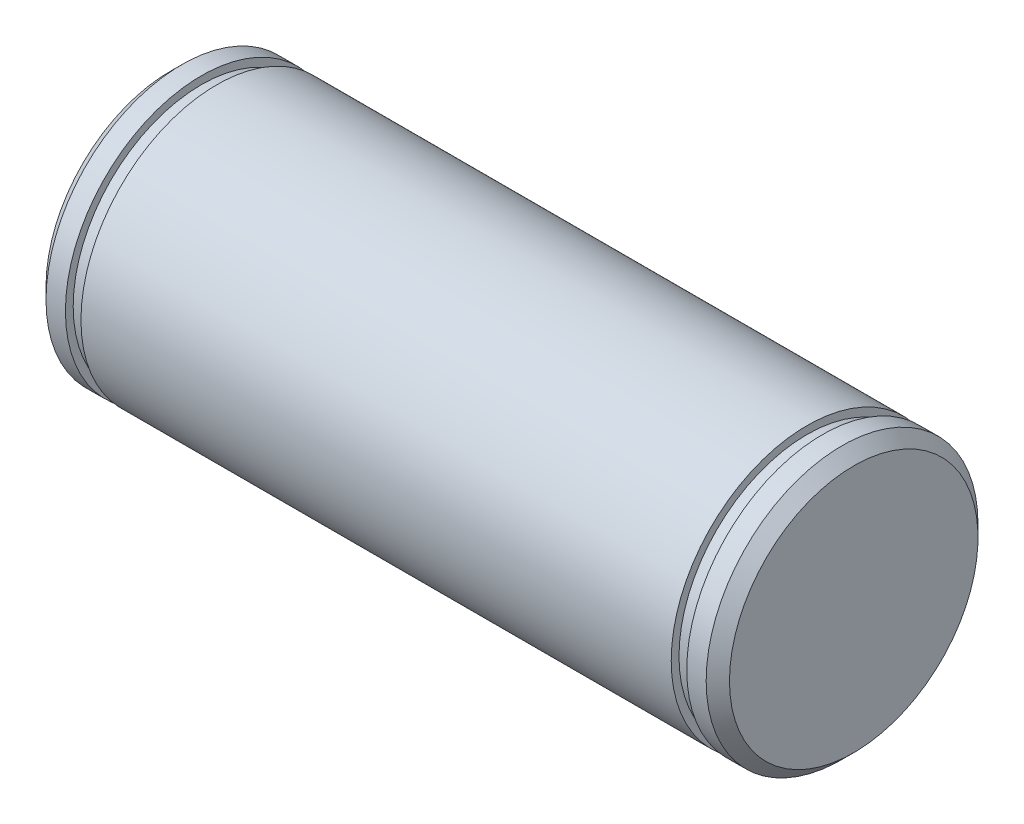
ISO-10303-21;
HEADER;
FILE_DESCRIPTION(('STEP AP214'),'2;1');
FILE_NAME('part.step','',(''),(''),'','','');
FILE_SCHEMA(('AUTOMOTIVE_DESIGN { 1 0 10303 214 1 1 1 1 }'));
ENDSEC;
DATA;
#1=APPLICATION_CONTEXT('core data for automotive mechanical design processes');
#2=APPLICATION_PROTOCOL_DEFINITION('international standard','automotive_design',2000,#1);
#3=PRODUCT_CONTEXT('',#1,'mechanical');
#4=PRODUCT('Part','Part','',(#3));
#5=PRODUCT_RELATED_PRODUCT_CATEGORY('part','',(#4));
#6=PRODUCT_DEFINITION_FORMATION('','',#4);
#7=PRODUCT_DEFINITION_CONTEXT('part definition',#1,'design');
#8=PRODUCT_DEFINITION('design','',#6,#7);
#9=PRODUCT_DEFINITION_SHAPE('','',#8);
#10=(LENGTH_UNIT() NAMED_UNIT(*) SI_UNIT(.MILLI.,.METRE.));
#11=(NAMED_UNIT(*) PLANE_ANGLE_UNIT() SI_UNIT($,.RADIAN.));
#12=(NAMED_UNIT(*) SI_UNIT($,.STERADIAN.) SOLID_ANGLE_UNIT());
#13=UNCERTAINTY_MEASURE_WITH_UNIT(LENGTH_MEASURE(1.E-05),#10,'distance_accuracy_value','');
#14=(GEOMETRIC_REPRESENTATION_CONTEXT(3) GLOBAL_UNCERTAINTY_ASSIGNED_CONTEXT((#13)) GLOBAL_UNIT_ASSIGNED_CONTEXT((#10,
#11,#12)) REPRESENTATION_CONTEXT('',''));
#15=CARTESIAN_POINT('',(0.,0.,0.));
#16=DIRECTION('',(0.,0.,1.));
#17=DIRECTION('',(1.,0.,0.));
#18=AXIS2_PLACEMENT_3D('',#15,#16,#17);
#19=CARTESIAN_POINT('',(0.,0.,0.));
#20=DIRECTION('',(-1.,0.,0.));
#21=DIRECTION('',(0.,0.,1.));
#22=AXIS2_PLACEMENT_3D('',#19,#20,#21);
#23=PLANE('',#22);
#24=CARTESIAN_POINT('',(0.,0.,0.));
#25=DIRECTION('',(-1.,0.,0.));
#26=DIRECTION('',(0.,0.,1.));
#27=AXIS2_PLACEMENT_3D('',#24,#25,#26);
#28=CIRCLE('',#27,16.);
#29=CARTESIAN_POINT('',(0.,0.,16.));
#30=VERTEX_POINT('',#29);
#31=EDGE_CURVE('E76',#30,#30,#28,.T.);
#32=ORIENTED_EDGE('',*,*,#31,.T.);
#33=EDGE_LOOP('',(#32));
#34=FACE_BOUND('',#33,.T.);
#35=ADVANCED_FACE('F36',(#34),#23,.T.);
#36=CARTESIAN_POINT('',(88.0000000000001,0.,0.));
#37=DIRECTION('',(-1.,0.,0.));
#38=DIRECTION('',(0.,0.,1.));
#39=AXIS2_PLACEMENT_3D('',#36,#37,#38);
#40=PLANE('',#39);
#41=CARTESIAN_POINT('',(88.0000000000001,0.,0.));
#42=DIRECTION('',(-1.,0.,0.));
#43=DIRECTION('',(0.,0.,1.));
#44=AXIS2_PLACEMENT_3D('',#41,#42,#43);
#45=CIRCLE('',#44,16.);
#46=CARTESIAN_POINT('',(88.0000000000001,0.,16.));
#47=VERTEX_POINT('',#46);
#48=EDGE_CURVE('E10',#47,#47,#45,.T.);
#49=ORIENTED_EDGE('',*,*,#48,.F.);
#50=EDGE_LOOP('',(#49));
#51=FACE_BOUND('',#50,.T.);
#52=ADVANCED_FACE('F117',(#51),#40,.F.);
#53=CARTESIAN_POINT('',(86.5,0.,0.));
#54=DIRECTION('',(-1.,0.,0.));
#55=DIRECTION('',(0.,0.,1.));
#56=AXIS2_PLACEMENT_3D('',#53,#54,#55);
#57=CONICAL_SURFACE('',#56,17.4999999999998,0.78539816339737);
#58=ORIENTED_EDGE('',*,*,#48,.T.);
#59=EDGE_LOOP('',(#58));
#60=FACE_BOUND('',#59,.T.);
#61=CARTESIAN_POINT('',(86.5,0.,0.));
#62=DIRECTION('',(-1.,0.,0.));
#63=DIRECTION('',(0.,0.,1.));
#64=AXIS2_PLACEMENT_3D('',#61,#62,#63);
#65=CIRCLE('',#64,17.4999999999998);
#66=CARTESIAN_POINT('',(86.5,0.,17.4999999999998));
#67=VERTEX_POINT('',#66);
#68=EDGE_CURVE('E42',#67,#67,#65,.T.);
#69=ORIENTED_EDGE('',*,*,#68,.F.);
#70=EDGE_LOOP('',(#69));
#71=FACE_BOUND('',#70,.T.);
#72=ADVANCED_FACE('F121',(#60,#71),#57,.T.);
#73=CARTESIAN_POINT('',(-1.99999999999978,0.,0.));
#74=DIRECTION('',(-1.,0.,0.));
#75=DIRECTION('',(0.,0.,1.));
#76=AXIS2_PLACEMENT_3D('',#73,#74,#75);
#77=CYLINDRICAL_SURFACE('',#76,17.4999999999998);
#78=CARTESIAN_POINT('',(84.0000000000005,0.,0.));
#79=DIRECTION('',(-1.,0.,0.));
#80=DIRECTION('',(0.,0.,1.));
#81=AXIS2_PLACEMENT_3D('',#78,#79,#80);
#82=CIRCLE('',#81,17.4999999999999);
#83=CARTESIAN_POINT('',(84.0000000000005,0.,17.4999999999999));
#84=VERTEX_POINT('',#83);
#85=EDGE_CURVE('E46',#84,#84,#82,.T.);
#86=ORIENTED_EDGE('',*,*,#85,.F.);
#87=EDGE_LOOP('',(#86));
#88=FACE_BOUND('',#87,.T.);
#89=ORIENTED_EDGE('',*,*,#68,.T.);
#90=EDGE_LOOP('',(#89));
#91=FACE_BOUND('',#90,.T.);
#92=ADVANCED_FACE('F126',(#88,#91),#77,.T.);
#93=CARTESIAN_POINT('',(84.0000000000005,0.,0.));
#94=DIRECTION('',(-1.,0.,0.));
#95=DIRECTION('',(0.,0.,1.));
#96=AXIS2_PLACEMENT_3D('',#93,#94,#95);
#97=PLANE('',#96);
#98=ORIENTED_EDGE('',*,*,#85,.T.);
#99=EDGE_LOOP('',(#98));
#100=FACE_BOUND('',#99,.T.);
#101=CARTESIAN_POINT('',(84.0000000000005,0.,0.));
#102=DIRECTION('',(-1.,0.,0.));
#103=DIRECTION('',(0.,0.,1.));
#104=AXIS2_PLACEMENT_3D('',#101,#102,#103);
#105=CIRCLE('',#104,16.5);
#106=CARTESIAN_POINT('',(84.0000000000005,0.,16.5));
#107=VERTEX_POINT('',#106);
#108=EDGE_CURVE('E50',#107,#107,#105,.T.);
#109=ORIENTED_EDGE('',*,*,#108,.F.);
#110=EDGE_LOOP('',(#109));
#111=FACE_BOUND('',#110,.T.);
#112=ADVANCED_FACE('F131',(#100,#111),#97,.T.);
#113=CARTESIAN_POINT('',(-1.99999999999978,0.,0.));
#114=DIRECTION('',(-1.,0.,0.));
#115=DIRECTION('',(0.,0.,1.));
#116=AXIS2_PLACEMENT_3D('',#113,#114,#115);
#117=CYLINDRICAL_SURFACE('',#116,16.5);
#118=ORIENTED_EDGE('',*,*,#108,.T.);
#119=EDGE_LOOP('',(#118));
#120=FACE_BOUND('',#119,.T.);
#121=CARTESIAN_POINT('',(81.9999999999999,0.,0.));
#122=DIRECTION('',(-1.,0.,0.));
#123=DIRECTION('',(0.,0.,1.));
#124=AXIS2_PLACEMENT_3D('',#121,#122,#123);
#125=CIRCLE('',#124,16.5);
#126=CARTESIAN_POINT('',(81.9999999999999,0.,16.5));
#127=VERTEX_POINT('',#126);
#128=EDGE_CURVE('E55',#127,#127,#125,.T.);
#129=ORIENTED_EDGE('',*,*,#128,.F.);
#130=EDGE_LOOP('',(#129));
#131=FACE_BOUND('',#130,.T.);
#132=ADVANCED_FACE('F135',(#120,#131),#117,.T.);
#133=CARTESIAN_POINT('',(81.9999999999999,0.,0.));
#134=DIRECTION('',(-1.,0.,0.));
#135=DIRECTION('',(0.,0.,1.));
#136=AXIS2_PLACEMENT_3D('',#133,#134,#135);
#137=PLANE('',#136);
#138=CARTESIAN_POINT('',(81.9999999999999,0.,0.));
#139=DIRECTION('',(-1.,0.,0.));
#140=DIRECTION('',(0.,0.,1.));
#141=AXIS2_PLACEMENT_3D('',#138,#139,#140);
#142=CIRCLE('',#141,17.4999999999999);
#143=CARTESIAN_POINT('',(81.9999999999999,0.,17.4999999999999));
#144=VERTEX_POINT('',#143);
#145=EDGE_CURVE('E58',#144,#144,#142,.T.);
#146=ORIENTED_EDGE('',*,*,#145,.F.);
#147=EDGE_LOOP('',(#146));
#148=FACE_BOUND('',#147,.T.);
#149=ORIENTED_EDGE('',*,*,#128,.T.);
#150=EDGE_LOOP('',(#149));
#151=FACE_BOUND('',#150,.T.);
#152=ADVANCED_FACE('F113',(#148,#151),#137,.F.);
#153=CARTESIAN_POINT('',(-1.99999999999978,0.,0.));
#154=DIRECTION('',(-1.,0.,0.));
#155=DIRECTION('',(0.,0.,1.));
#156=AXIS2_PLACEMENT_3D('',#153,#154,#155);
#157=CYLINDRICAL_SURFACE('',#156,17.4999999999999);
#158=CARTESIAN_POINT('',(6.00000000000023,0.,0.));
#159=DIRECTION('',(-1.,0.,0.));
#160=DIRECTION('',(0.,0.,1.));
#161=AXIS2_PLACEMENT_3D('',#158,#159,#160);
#162=CIRCLE('',#161,17.4999999999999);
#163=CARTESIAN_POINT('',(6.00000000000023,0.,17.4999999999999));
#164=VERTEX_POINT('',#163);
#165=EDGE_CURVE('E61',#164,#164,#162,.T.);
#166=ORIENTED_EDGE('',*,*,#165,.F.);
#167=EDGE_LOOP('',(#166));
#168=FACE_BOUND('',#167,.T.);
#169=ORIENTED_EDGE('',*,*,#145,.T.);
#170=EDGE_LOOP('',(#169));
#171=FACE_BOUND('',#170,.T.);
#172=ADVANCED_FACE('F107',(#168,#171),#157,.T.);
#173=CARTESIAN_POINT('',(6.00000000000023,0.,0.));
#174=DIRECTION('',(-1.,0.,0.));
#175=DIRECTION('',(0.,0.,1.));
#176=AXIS2_PLACEMENT_3D('',#173,#174,#175);
#177=PLANE('',#176);
#178=ORIENTED_EDGE('',*,*,#165,.T.);
#179=EDGE_LOOP('',(#178));
#180=FACE_BOUND('',#179,.T.);
#181=CARTESIAN_POINT('',(6.00000000000023,0.,0.));
#182=DIRECTION('',(-1.,0.,0.));
#183=DIRECTION('',(0.,0.,1.));
#184=AXIS2_PLACEMENT_3D('',#181,#182,#183);
#185=CIRCLE('',#184,16.5);
#186=CARTESIAN_POINT('',(6.00000000000023,0.,16.5));
#187=VERTEX_POINT('',#186);
#188=EDGE_CURVE('E64',#187,#187,#185,.T.);
#189=ORIENTED_EDGE('',*,*,#188,.F.);
#190=EDGE_LOOP('',(#189));
#191=FACE_BOUND('',#190,.T.);
#192=ADVANCED_FACE('F102',(#180,#191),#177,.T.);
#193=CARTESIAN_POINT('',(-1.99999999999978,0.,0.));
#194=DIRECTION('',(-1.,0.,0.));
#195=DIRECTION('',(0.,0.,1.));
#196=AXIS2_PLACEMENT_3D('',#193,#194,#195);
#197=CYLINDRICAL_SURFACE('',#196,16.5);
#198=CARTESIAN_POINT('',(4.00000000000045,0.,0.));
#199=DIRECTION('',(-1.,0.,0.));
#200=DIRECTION('',(0.,0.,1.));
#201=AXIS2_PLACEMENT_3D('',#198,#199,#200);
#202=CIRCLE('',#201,16.5);
#203=CARTESIAN_POINT('',(4.00000000000045,0.,16.5));
#204=VERTEX_POINT('',#203);
#205=EDGE_CURVE('E67',#204,#204,#202,.T.);
#206=ORIENTED_EDGE('',*,*,#205,.F.);
#207=EDGE_LOOP('',(#206));
#208=FACE_BOUND('',#207,.T.);
#209=ORIENTED_EDGE('',*,*,#188,.T.);
#210=EDGE_LOOP('',(#209));
#211=FACE_BOUND('',#210,.T.);
#212=ADVANCED_FACE('F96',(#208,#211),#197,.T.);
#213=CARTESIAN_POINT('',(4.00000000000045,0.,0.));
#214=DIRECTION('',(-1.,0.,0.));
#215=DIRECTION('',(0.,0.,1.));
#216=AXIS2_PLACEMENT_3D('',#213,#214,#215);
#217=PLANE('',#216);
#218=CARTESIAN_POINT('',(4.00000000000045,0.,0.));
#219=DIRECTION('',(-1.,0.,0.));
#220=DIRECTION('',(0.,0.,1.));
#221=AXIS2_PLACEMENT_3D('',#218,#219,#220);
#222=CIRCLE('',#221,17.4999999999999);
#223=CARTESIAN_POINT('',(4.00000000000045,0.,17.4999999999999));
#224=VERTEX_POINT('',#223);
#225=EDGE_CURVE('E70',#224,#224,#222,.T.);
#226=ORIENTED_EDGE('',*,*,#225,.F.);
#227=EDGE_LOOP('',(#226));
#228=FACE_BOUND('',#227,.T.);
#229=ORIENTED_EDGE('',*,*,#205,.T.);
#230=EDGE_LOOP('',(#229));
#231=FACE_BOUND('',#230,.T.);
#232=ADVANCED_FACE('F90',(#228,#231),#217,.F.);
#233=CARTESIAN_POINT('',(-1.99999999999978,0.,0.));
#234=DIRECTION('',(-1.,0.,0.));
#235=DIRECTION('',(0.,0.,1.));
#236=AXIS2_PLACEMENT_3D('',#233,#234,#235);
#237=CYLINDRICAL_SURFACE('',#236,17.4999999999999);
#238=CARTESIAN_POINT('',(1.50000000000006,0.,0.));
#239=DIRECTION('',(-1.,0.,0.));
#240=DIRECTION('',(0.,0.,1.));
#241=AXIS2_PLACEMENT_3D('',#238,#239,#240);
#242=CIRCLE('',#241,17.4999999999999);
#243=CARTESIAN_POINT('',(1.50000000000006,0.,17.4999999999999));
#244=VERTEX_POINT('',#243);
#245=EDGE_CURVE('E73',#244,#244,#242,.T.);
#246=ORIENTED_EDGE('',*,*,#245,.F.);
#247=EDGE_LOOP('',(#246));
#248=FACE_BOUND('',#247,.T.);
#249=ORIENTED_EDGE('',*,*,#225,.T.);
#250=EDGE_LOOP('',(#249));
#251=FACE_BOUND('',#250,.T.);
#252=ADVANCED_FACE('F84',(#248,#251),#237,.T.);
#253=CARTESIAN_POINT('',(1.50000000000006,0.,0.));
#254=DIRECTION('',(1.,0.,0.));
#255=DIRECTION('',(0.,0.,-1.));
#256=AXIS2_PLACEMENT_3D('',#253,#254,#255);
#257=CONICAL_SURFACE('',#256,17.4999999999999,0.785398163397374);
#258=ORIENTED_EDGE('',*,*,#31,.F.);
#259=EDGE_LOOP('',(#258));
#260=FACE_BOUND('',#259,.T.);
#261=ORIENTED_EDGE('',*,*,#245,.T.);
#262=EDGE_LOOP('',(#261));
#263=FACE_BOUND('',#262,.T.);
#264=ADVANCED_FACE('F81',(#260,#263),#257,.T.);
#265=CLOSED_SHELL('',(#35,#52,#72,#92,#112,#132,#152,#172,#192,#212,#232,#252,#264));
#266=MANIFOLD_SOLID_BREP('B2',#265);
#267=ADVANCED_BREP_SHAPE_REPRESENTATION('',(#18,#266),#14);
#268=SHAPE_DEFINITION_REPRESENTATION(#9,#267);
ENDSEC;
END-ISO-10303-21;
